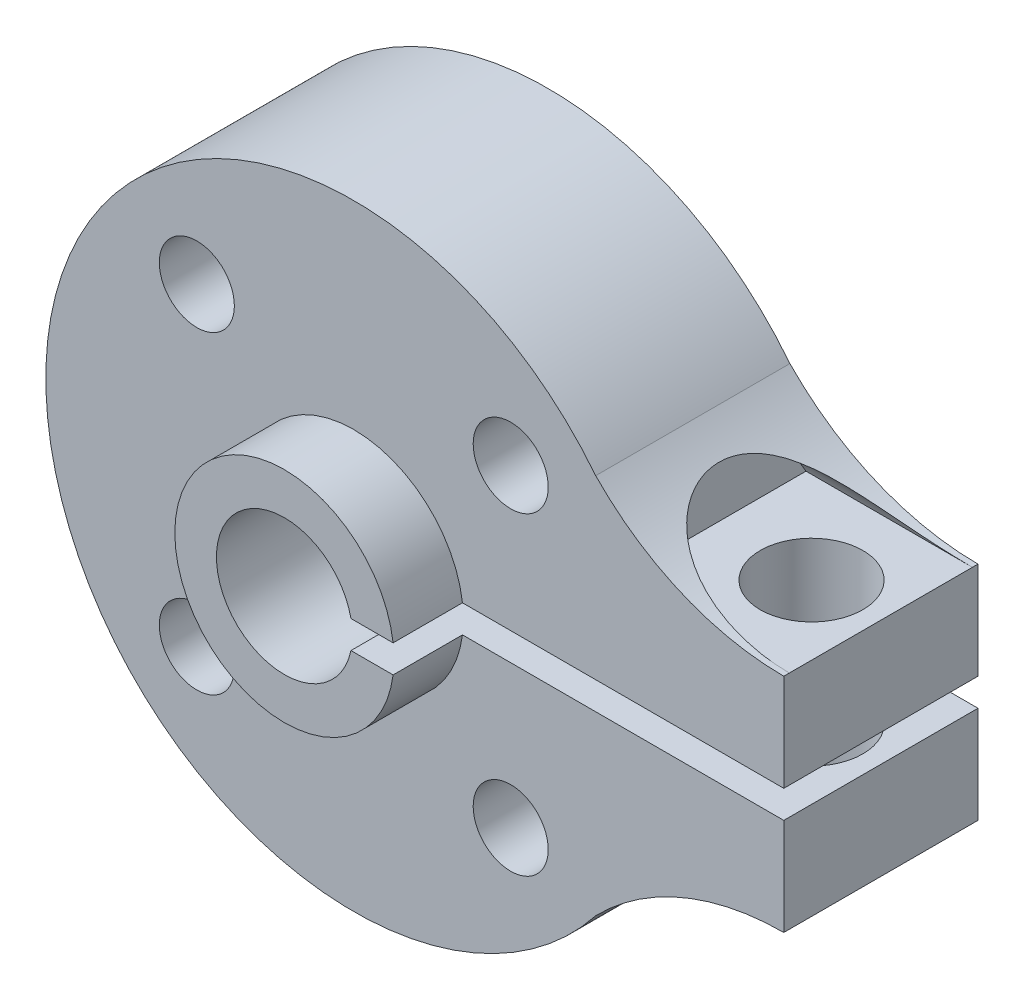
ISO-10303-21;
HEADER;
FILE_DESCRIPTION(('STEP AP214'),'2;1');
FILE_NAME('part.step','',(''),(''),'','','');
FILE_SCHEMA(('AUTOMOTIVE_DESIGN { 1 0 10303 214 1 1 1 1 }'));
ENDSEC;
DATA;
#1=APPLICATION_CONTEXT('core data for automotive mechanical design processes');
#2=APPLICATION_PROTOCOL_DEFINITION('international standard','automotive_design',2000,#1);
#3=PRODUCT_CONTEXT('',#1,'mechanical');
#4=PRODUCT('Part','Part','',(#3));
#5=PRODUCT_RELATED_PRODUCT_CATEGORY('part','',(#4));
#6=PRODUCT_DEFINITION_FORMATION('','',#4);
#7=PRODUCT_DEFINITION_CONTEXT('part definition',#1,'design');
#8=PRODUCT_DEFINITION('design','',#6,#7);
#9=PRODUCT_DEFINITION_SHAPE('','',#8);
#10=(LENGTH_UNIT() NAMED_UNIT(*) SI_UNIT(.MILLI.,.METRE.));
#11=(NAMED_UNIT(*) PLANE_ANGLE_UNIT() SI_UNIT($,.RADIAN.));
#12=(NAMED_UNIT(*) SI_UNIT($,.STERADIAN.) SOLID_ANGLE_UNIT());
#13=UNCERTAINTY_MEASURE_WITH_UNIT(LENGTH_MEASURE(1.E-05),#10,'distance_accuracy_value','');
#14=(GEOMETRIC_REPRESENTATION_CONTEXT(3) GLOBAL_UNCERTAINTY_ASSIGNED_CONTEXT((#13)) GLOBAL_UNIT_ASSIGNED_CONTEXT((#10,
#11,#12)) REPRESENTATION_CONTEXT('',''));
#15=CARTESIAN_POINT('',(0.,0.,0.));
#16=DIRECTION('',(0.,0.,1.));
#17=DIRECTION('',(1.,0.,0.));
#18=AXIS2_PLACEMENT_3D('',#15,#16,#17);
#19=CARTESIAN_POINT('',(15.5,-0.5,-7.));
#20=DIRECTION('',(1.,0.,0.));
#21=DIRECTION('',(0.,0.,-1.));
#22=AXIS2_PLACEMENT_3D('',#19,#20,#21);
#23=PLANE('',#22);
#24=DIRECTION('',(0.,0.,-1.));
#25=VECTOR('',#24,1.);
#26=CARTESIAN_POINT('',(15.5,0.5,2.5));
#27=LINE('',#26,#25);
#28=CARTESIAN_POINT('',(15.5,0.5,0.));
#29=VERTEX_POINT('',#28);
#30=CARTESIAN_POINT('',(15.5,0.5,-7.));
#31=VERTEX_POINT('',#30);
#32=EDGE_CURVE('E359',#29,#31,#27,.T.);
#33=ORIENTED_EDGE('',*,*,#32,.T.);
#34=DIRECTION('',(0.,1.,0.));
#35=VECTOR('',#34,1.);
#36=CARTESIAN_POINT('',(15.5,-13.4475790201,-7.));
#37=LINE('',#36,#35);
#38=CARTESIAN_POINT('',(15.5,4.000000000001,-7.));
#39=VERTEX_POINT('',#38);
#40=EDGE_CURVE('E318',#31,#39,#37,.T.);
#41=ORIENTED_EDGE('',*,*,#40,.T.);
#42=DIRECTION('',(0.,0.,1.));
#43=VECTOR('',#42,1.);
#44=CARTESIAN_POINT('',(15.5,4.000000000001,-7.));
#45=LINE('',#44,#43);
#46=CARTESIAN_POINT('',(15.5,4.0000000000005,-6.79999999999967));
#47=VERTEX_POINT('',#46);
#48=EDGE_CURVE('E136',#39,#47,#45,.T.);
#49=ORIENTED_EDGE('',*,*,#48,.T.);
#50=DIRECTION('',(0.,0.,-1.));
#51=VECTOR('',#50,1.);
#52=CARTESIAN_POINT('',(15.5,4.,-7.));
#53=LINE('',#52,#51);
#54=CARTESIAN_POINT('',(15.5,4.0000000000005,-0.200000000000335));
#55=VERTEX_POINT('',#54);
#56=EDGE_CURVE('E122',#47,#55,#53,.F.);
#57=ORIENTED_EDGE('',*,*,#56,.T.);
#58=DIRECTION('',(0.,0.,1.));
#59=VECTOR('',#58,1.);
#60=CARTESIAN_POINT('',(15.5,4.000000000001,-7.));
#61=LINE('',#60,#59);
#62=CARTESIAN_POINT('',(15.5,4.000000000001,0.));
#63=VERTEX_POINT('',#62);
#64=EDGE_CURVE('E121',#55,#63,#61,.T.);
#65=ORIENTED_EDGE('',*,*,#64,.T.);
#66=DIRECTION('',(0.,1.,0.));
#67=VECTOR('',#66,1.);
#68=CARTESIAN_POINT('',(15.5,-13.4475790201,0.));
#69=LINE('',#68,#67);
#70=EDGE_CURVE('E223',#29,#63,#69,.T.);
#71=ORIENTED_EDGE('',*,*,#70,.F.);
#72=EDGE_LOOP('',(#33,#41,#49,#57,#65,#71));
#73=FACE_BOUND('',#72,.T.);
#74=ADVANCED_FACE('F45',(#73),#23,.T.);
#75=CARTESIAN_POINT('',(15.5,-13.4475790201,0.));
#76=DIRECTION('',(0.,0.,1.));
#77=DIRECTION('',(1.,0.,0.));
#78=AXIS2_PLACEMENT_3D('',#75,#76,#77);
#79=PLANE('',#78);
#80=CARTESIAN_POINT('',(-5.656516224816,5.657192253971,0.));
#81=DIRECTION('',(0.,0.,1.));
#82=DIRECTION('',(1.,0.,0.));
#83=AXIS2_PLACEMENT_3D('',#80,#81,#82);
#84=CIRCLE('',#83,1.35254999999999);
#85=CARTESIAN_POINT('',(-4.30396622481601,5.657192253971,0.));
#86=VERTEX_POINT('',#85);
#87=EDGE_CURVE('E397',#86,#86,#84,.T.);
#88=ORIENTED_EDGE('',*,*,#87,.F.);
#89=EDGE_LOOP('',(#88));
#90=FACE_BOUND('',#89,.T.);
#91=CARTESIAN_POINT('',(5.657192253971,5.656516224816,0.));
#92=DIRECTION('',(0.,0.,1.));
#93=DIRECTION('',(1.,0.,0.));
#94=AXIS2_PLACEMENT_3D('',#91,#92,#93);
#95=CIRCLE('',#94,1.35254999999999);
#96=CARTESIAN_POINT('',(7.00974225397099,5.656516224816,0.));
#97=VERTEX_POINT('',#96);
#98=EDGE_CURVE('E391',#97,#97,#95,.T.);
#99=ORIENTED_EDGE('',*,*,#98,.F.);
#100=EDGE_LOOP('',(#99));
#101=FACE_BOUND('',#100,.T.);
#102=CARTESIAN_POINT('',(5.656516224816,-5.657192253971,0.));
#103=DIRECTION('',(0.,0.,1.));
#104=DIRECTION('',(1.,0.,0.));
#105=AXIS2_PLACEMENT_3D('',#102,#103,#104);
#106=CIRCLE('',#105,1.35254999999999);
#107=CARTESIAN_POINT('',(7.00906622481599,-5.657192253971,0.));
#108=VERTEX_POINT('',#107);
#109=EDGE_CURVE('E385',#108,#108,#106,.T.);
#110=ORIENTED_EDGE('',*,*,#109,.F.);
#111=EDGE_LOOP('',(#110));
#112=FACE_BOUND('',#111,.T.);
#113=CARTESIAN_POINT('',(-5.657192253971,-5.656516224816,0.));
#114=DIRECTION('',(0.,0.,1.));
#115=DIRECTION('',(1.,0.,0.));
#116=AXIS2_PLACEMENT_3D('',#113,#114,#115);
#117=CIRCLE('',#116,1.35254999999999);
#118=CARTESIAN_POINT('',(-4.30464225397101,-5.656516224816,0.));
#119=VERTEX_POINT('',#118);
#120=EDGE_CURVE('E379',#119,#119,#117,.T.);
#121=ORIENTED_EDGE('',*,*,#120,.F.);
#122=EDGE_LOOP('',(#121));
#123=FACE_BOUND('',#122,.T.);
#124=DIRECTION('',(-1.,0.,0.));
#125=VECTOR('',#124,1.);
#126=CARTESIAN_POINT('',(15.5,0.5,0.));
#127=LINE('',#126,#125);
#128=CARTESIAN_POINT('',(3.91822663969301,0.5,0.));
#129=VERTEX_POINT('',#128);
#130=EDGE_CURVE('E344',#29,#129,#127,.T.);
#131=ORIENTED_EDGE('',*,*,#130,.F.);
#132=ORIENTED_EDGE('',*,*,#70,.T.);
#133=CARTESIAN_POINT('',(15.5,13.4475790201,0.));
#134=DIRECTION('',(0.,0.,1.));
#135=DIRECTION('',(1.,0.,0.));
#136=AXIS2_PLACEMENT_3D('',#133,#134,#135);
#137=CIRCLE('',#136,9.447579020099);
#138=CARTESIAN_POINT('',(8.71986454121394,6.86833039267039,0.));
#139=VERTEX_POINT('',#138);
#140=EDGE_CURVE('E141',#63,#139,#137,.F.);
#141=ORIENTED_EDGE('',*,*,#140,.T.);
#142=CARTESIAN_POINT('',(0.,0.,0.));
#143=DIRECTION('',(0.,0.,1.));
#144=DIRECTION('',(1.,0.,0.));
#145=AXIS2_PLACEMENT_3D('',#142,#143,#144);
#146=CIRCLE('',#145,11.1);
#147=CARTESIAN_POINT('',(8.71986454121394,-6.86833039267039,0.));
#148=VERTEX_POINT('',#147);
#149=EDGE_CURVE('E58',#148,#139,#146,.F.);
#150=ORIENTED_EDGE('',*,*,#149,.F.);
#151=CARTESIAN_POINT('',(15.5,-13.4475790201,0.));
#152=DIRECTION('',(0.,0.,1.));
#153=DIRECTION('',(1.,0.,0.));
#154=AXIS2_PLACEMENT_3D('',#151,#152,#153);
#155=CIRCLE('',#154,9.447579020099);
#156=CARTESIAN_POINT('',(15.5,-4.000000000001,0.));
#157=VERTEX_POINT('',#156);
#158=EDGE_CURVE('E74',#148,#157,#155,.F.);
#159=ORIENTED_EDGE('',*,*,#158,.T.);
#160=CARTESIAN_POINT('',(15.5,-0.5,0.));
#161=VERTEX_POINT('',#160);
#162=EDGE_CURVE('E200',#157,#161,#69,.T.);
#163=ORIENTED_EDGE('',*,*,#162,.T.);
#164=DIRECTION('',(1.,0.,0.));
#165=VECTOR('',#164,1.);
#166=CARTESIAN_POINT('',(15.5,-0.5,0.));
#167=LINE('',#166,#165);
#168=CARTESIAN_POINT('',(3.91822663969301,-0.5,0.));
#169=VERTEX_POINT('',#168);
#170=EDGE_CURVE('E352',#169,#161,#167,.T.);
#171=ORIENTED_EDGE('',*,*,#170,.F.);
#172=CARTESIAN_POINT('',(0.,0.,0.));
#173=DIRECTION('',(0.,0.,1.));
#174=DIRECTION('',(1.,0.,0.));
#175=AXIS2_PLACEMENT_3D('',#172,#173,#174);
#176=CIRCLE('',#175,3.95);
#177=EDGE_CURVE('E341',#129,#169,#176,.T.);
#178=ORIENTED_EDGE('',*,*,#177,.F.);
#179=EDGE_LOOP('',(#131,#132,#141,#150,#159,#163,#171,#178));
#180=FACE_BOUND('',#179,.T.);
#181=ADVANCED_FACE('F273',(#90,#101,#112,#123,#180),#79,.T.);
#182=CARTESIAN_POINT('',(9.5,4.,-0.2));
#183=DIRECTION('',(0.,-1.,0.));
#184=DIRECTION('',(0.,0.,-1.));
#185=AXIS2_PLACEMENT_3D('',#182,#183,#184);
#186=PLANE('',#185);
#187=CARTESIAN_POINT('',(13.,4.,-3.5));
#188=DIRECTION('',(0.,1.,0.));
#189=DIRECTION('',(0.,0.,1.));
#190=AXIS2_PLACEMENT_3D('',#187,#188,#189);
#191=CIRCLE('',#190,1.84999999999999);
#192=CARTESIAN_POINT('',(13.,4.,-1.65000000000001));
#193=VERTEX_POINT('',#192);
#194=EDGE_CURVE('E409',#193,#193,#191,.T.);
#195=ORIENTED_EDGE('',*,*,#194,.F.);
#196=EDGE_LOOP('',(#195));
#197=FACE_BOUND('',#196,.T.);
#198=DIRECTION('',(1.,0.,0.));
#199=VECTOR('',#198,1.);
#200=CARTESIAN_POINT('',(9.5,3.99999999999994,-6.79999999999987));
#201=LINE('',#200,#199);
#202=CARTESIAN_POINT('',(9.5,3.99999999999997,-6.79999999999986));
#203=VERTEX_POINT('',#202);
#204=EDGE_CURVE('E115',#47,#203,#201,.F.);
#205=ORIENTED_EDGE('',*,*,#204,.T.);
#206=DIRECTION('',(0.,0.,-1.));
#207=VECTOR('',#206,1.);
#208=CARTESIAN_POINT('',(9.5,3.99999999999997,-0.200000000000142));
#209=LINE('',#208,#207);
#210=CARTESIAN_POINT('',(9.5,3.99999999999997,-0.200000000000142));
#211=VERTEX_POINT('',#210);
#212=EDGE_CURVE('E128',#211,#203,#209,.T.);
#213=ORIENTED_EDGE('',*,*,#212,.F.);
#214=DIRECTION('',(1.,0.,0.));
#215=VECTOR('',#214,1.);
#216=CARTESIAN_POINT('',(9.5,3.99999999999994,-0.200000000000125));
#217=LINE('',#216,#215);
#218=EDGE_CURVE('E112',#211,#55,#217,.T.);
#219=ORIENTED_EDGE('',*,*,#218,.T.);
#220=ORIENTED_EDGE('',*,*,#56,.F.);
#221=EDGE_LOOP('',(#205,#213,#219,#220));
#222=FACE_BOUND('',#221,.T.);
#223=ADVANCED_FACE('F47',(#197,#222),#186,.F.);
#224=CARTESIAN_POINT('',(9.5,2.308194299318,-3.5));
#225=DIRECTION('',(1.,0.,0.));
#226=DIRECTION('',(0.,0.,-1.));
#227=AXIS2_PLACEMENT_3D('',#224,#225,#226);
#228=CYLINDRICAL_SURFACE('',#227,3.708396759903);
#229=ORIENTED_EDGE('',*,*,#218,.F.);
#230=CARTESIAN_POINT('',(9.5,2.308194299318,-3.5));
#231=DIRECTION('',(1.,0.,0.));
#232=DIRECTION('',(0.,0.,-1.));
#233=AXIS2_PLACEMENT_3D('',#230,#231,#232);
#234=CIRCLE('',#233,3.708396759903);
#235=EDGE_CURVE('E337',#203,#211,#234,.T.);
#236=ORIENTED_EDGE('',*,*,#235,.F.);
#237=ORIENTED_EDGE('',*,*,#204,.F.);
#238=CARTESIAN_POINT('',(15.5,4.000000000001,-6.79999999999933));
#239=CARTESIAN_POINT('',(15.3854172561424,3.99999807144366,-6.7999904035741));
#240=CARTESIAN_POINT('',(15.2708345037205,4.00208452565223,-6.79893104370679));
#241=CARTESIAN_POINT('',(15.0418545088415,4.01042007363627,-6.79464326988314));
#242=CARTESIAN_POINT('',(14.9274572778291,4.01666941510702,-6.79141472685848));
#243=CARTESIAN_POINT('',(14.6988557808847,4.033330584123,-6.78271174393158));
#244=CARTESIAN_POINT('',(14.5846521614544,4.04374938302985,-6.77723354218102));
#245=CARTESIAN_POINT('',(14.3568466591298,4.06871528645758,-6.76388854983073));
#246=CARTESIAN_POINT('',(14.2432447653975,4.08326231636308,-6.7560218024024));
#247=CARTESIAN_POINT('',(13.9012476272517,4.1333872690603,-6.72837211210126));
#248=CARTESIAN_POINT('',(13.6740472792939,4.17527511633308,-6.70462249151927));
#249=CARTESIAN_POINT('',(13.2250868669367,4.27510326310617,-6.64434186929708));
#250=CARTESIAN_POINT('',(13.0033221022713,4.33302911979379,-6.6078223596639));
#251=CARTESIAN_POINT('',(12.6529356022988,4.43813091397781,-6.5360933101411));
#252=CARTESIAN_POINT('',(12.5218503492449,4.48063203510989,-6.50597227338658));
#253=CARTESIAN_POINT('',(12.2632290057736,4.57071030493148,-6.4387742668089));
#254=CARTESIAN_POINT('',(12.1356928962293,4.61828742625897,-6.40169733448045));
#255=CARTESIAN_POINT('',(11.8854487831593,4.71775519771889,-6.31963922664217));
#256=CARTESIAN_POINT('',(11.7627254940685,4.76963022726134,-6.27468606548825));
#257=CARTESIAN_POINT('',(11.5227135874733,4.87697578128279,-6.17561107592043));
#258=CARTESIAN_POINT('',(11.4054232772463,4.93244517278872,-6.12149212804335));
#259=CARTESIAN_POINT('',(11.1256985684184,5.07163984609245,-5.97585734382027));
#260=CARTESIAN_POINT('',(10.9669053561294,5.15677415238754,-5.87851068639026));
#261=CARTESIAN_POINT('',(10.6682954041519,5.32718244619876,-5.65805983866001));
#262=CARTESIAN_POINT('',(10.5284532138092,5.41245608755708,-5.53499076935242));
#263=CARTESIAN_POINT('',(10.3029570714859,5.5570021638199,-5.29236628463541));
#264=CARTESIAN_POINT('',(10.2122236670473,5.61776209979507,-5.17843958840104));
#265=CARTESIAN_POINT('',(10.0487893069128,5.73065496290757,-4.9342150554859));
#266=CARTESIAN_POINT('',(9.97608268610899,5.78279059860418,-4.80392238142926));
#267=CARTESIAN_POINT('',(9.88271984953715,5.85123562170807,-4.59746178007822));
#268=CARTESIAN_POINT('',(9.85411340712846,5.87250463892861,-4.5264262545005));
#269=CARTESIAN_POINT('',(9.80265428832986,5.9111320266464,-4.38128999145526));
#270=CARTESIAN_POINT('',(9.77979860146265,5.92849244276414,-4.30719088150572));
#271=CARTESIAN_POINT('',(9.74015073098196,5.9588198482869,-4.15653545136068));
#272=CARTESIAN_POINT('',(9.72335620443627,5.97178853518828,-4.07998009311161));
#273=CARTESIAN_POINT('',(9.696047876865,5.99297113329569,-3.92514115874171));
#274=CARTESIAN_POINT('',(9.68553304823525,6.00118582243485,-3.84685786755357));
#275=CARTESIAN_POINT('',(9.66571269419219,6.01668686364098,-3.63272797682019));
#276=CARTESIAN_POINT('',(9.66268060711631,6.01908388455562,-3.49585578487399));
#277=CARTESIAN_POINT('',(9.67580092483682,6.00879517138083,-3.22372435833189));
#278=CARTESIAN_POINT('',(9.69194697787978,5.99611443100789,-3.08846460468274));
#279=CARTESIAN_POINT('',(9.74140060570531,5.95784036040179,-2.83033541035466));
#280=CARTESIAN_POINT('',(9.77379479620589,5.93293564756332,-2.7071855921698));
#281=CARTESIAN_POINT('',(9.85403038461476,5.872469667333,-2.46884489684085));
#282=CARTESIAN_POINT('',(9.90187372262332,5.83690706156584,-2.35365502151125));
#283=CARTESIAN_POINT('',(10.0153708669385,5.7546713103554,-2.12530832541407));
#284=CARTESIAN_POINT('',(10.0820564209881,5.70738398145087,-2.01289063057066));
#285=CARTESIAN_POINT('',(10.22922218102,5.60643161923737,-1.80068540326632));
#286=CARTESIAN_POINT('',(10.309709454311,5.55276332282879,-1.70090438727932));
#287=CARTESIAN_POINT('',(10.4617575283387,5.45514545743429,-1.53638994983432));
#288=CARTESIAN_POINT('',(10.5309064551325,5.41191057285581,-1.46895760039852));
#289=CARTESIAN_POINT('',(10.6750840937544,5.324523005541,-1.34130785397833));
#290=CARTESIAN_POINT('',(10.7501152592569,5.28036994550683,-1.28109349462586));
#291=CARTESIAN_POINT('',(10.9053325302062,5.19204954805676,-1.16745307872609));
#292=CARTESIAN_POINT('',(10.9855265073732,5.14788229613576,-1.11403777634661));
#293=CARTESIAN_POINT('',(11.1502648300501,5.06037063385568,-1.01360351201172));
#294=CARTESIAN_POINT('',(11.2348105538105,5.01702649020907,-0.966586593895724));
#295=CARTESIAN_POINT('',(11.4491601443286,4.91131764268612,-0.857234031716602));
#296=CARTESIAN_POINT('',(11.5811855099728,4.8498240739921,-0.798397249947358));
#297=CARTESIAN_POINT('',(11.8517008005578,4.73158833415588,-0.691850969184867));
#298=CARTESIAN_POINT('',(11.9901938582427,4.67484850353973,-0.644146931053634));
#299=CARTESIAN_POINT('',(12.2727994055449,4.5669886617629,-0.558090419685307));
#300=CARTESIAN_POINT('',(12.4169310013115,4.51589049754474,-0.519773645045218));
#301=CARTESIAN_POINT('',(12.7092115298463,4.42029218777587,-0.451279086549204));
#302=CARTESIAN_POINT('',(12.8573601583155,4.37579154409137,-0.421100688078936));
#303=CARTESIAN_POINT('',(13.2088503671513,4.27964035910178,-0.358348077633359));
#304=CARTESIAN_POINT('',(13.4134887431066,4.2308754157282,-0.328582782000245));
#305=CARTESIAN_POINT('',(13.8267983828851,4.14695137700744,-0.27920251319476));
#306=CARTESIAN_POINT('',(14.0354716910446,4.11179937907123,-0.259592833085457));
#307=CARTESIAN_POINT('',(14.4530137871783,4.05585754801128,-0.229084764078983));
#308=CARTESIAN_POINT('',(14.6618549020669,4.03491321046744,-0.218092452134431));
#309=CARTESIAN_POINT('',(14.9758505914236,4.01396785329366,-0.207190475716648));
#310=CARTESIAN_POINT('',(15.0805924216452,4.00873126349106,-0.204487528313254));
#311=CARTESIAN_POINT('',(15.2902194458755,4.00174728093327,-0.20089500314409));
#312=CARTESIAN_POINT('',(15.3951046341522,3.99999975253445,-0.200005354882977));
#313=CARTESIAN_POINT('',(15.5,4.000000000001,-0.20000000000067));
#314=B_SPLINE_CURVE_WITH_KNOTS('',3,(#238,#239,#240,#241,#242,#243,#244,#245,#246,#247,#248,
#249,#250,#251,#252,#253,#254,#255,#256,#257,#258,#259,#260,#261,#262,#263,#264,#265,#266,#267,
#268,#269,#270,#271,#272,#273,#274,#275,#276,#277,#278,#279,#280,#281,#282,#283,#284,#285,#286,
#287,#288,#289,#290,#291,#292,#293,#294,#295,#296,#297,#298,#299,#300,#301,#302,#303,#304,#305,
#306,#307,#308,#309,#310,#311,#312,#313),.UNSPECIFIED.,.F.,.F.,(4,2,2,2,2,2,2,2,2,2,2,2,2,2,2,2,
2,2,2,2,2,2,2,2,2,2,2,2,2,2,2,2,2,2,2,2,2,4),(0.,0.343723971843453,0.687468397378237,
1.03178998346866,1.37610534654163,2.07189509147115,2.76706027899586,3.18996821448582,
3.6128738704195,4.03430477997258,4.45560349113267,5.06790502421491,5.67937592856019,
6.15105760704194,6.62259086613528,6.86072027072375,7.09872475577593,7.33663714177156,
7.57451058532161,7.98295112010445,8.39125641808473,8.77882172170296,9.16643571462009,
9.58186622266672,9.99751009479279,10.3145531519351,10.6317291690766,10.9494007936113,
11.2671736551701,11.7376814003825,12.20841945742,12.6809208132666,13.1533864755692,
13.7899635271677,14.4268720269268,15.0567382504871,15.37139764566,15.686044807636),.UNSPECIFIED.);
#315=EDGE_CURVE('E107',#47,#55,#314,.T.);
#316=ORIENTED_EDGE('',*,*,#315,.T.);
#317=EDGE_LOOP('',(#229,#236,#237,#316));
#318=FACE_BOUND('',#317,.T.);
#319=ADVANCED_FACE('F109',(#318),#228,.F.);
#320=DIRECTION('',(0.,0.,-1.));
#321=VECTOR('',#320,1.);
#322=CARTESIAN_POINT('',(15.5,-0.5,2.5));
#323=LINE('',#322,#321);
#324=CARTESIAN_POINT('',(15.5,-0.5,-7.));
#325=VERTEX_POINT('',#324);
#326=EDGE_CURVE('E361',#161,#325,#323,.T.);
#327=ORIENTED_EDGE('',*,*,#326,.F.);
#328=ORIENTED_EDGE('',*,*,#162,.F.);
#329=DIRECTION('',(0.,0.,1.));
#330=VECTOR('',#329,1.);
#331=CARTESIAN_POINT('',(15.5,-4.000000000001,-7.));
#332=LINE('',#331,#330);
#333=CARTESIAN_POINT('',(15.5,-4.000000000001,-7.));
#334=VERTEX_POINT('',#333);
#335=EDGE_CURVE('E153',#157,#334,#332,.F.);
#336=ORIENTED_EDGE('',*,*,#335,.T.);
#337=EDGE_CURVE('E312',#334,#325,#37,.T.);
#338=ORIENTED_EDGE('',*,*,#337,.T.);
#339=EDGE_LOOP('',(#327,#328,#336,#338));
#340=FACE_BOUND('',#339,.T.);
#341=ADVANCED_FACE('F263',(#340),#23,.T.);
#342=CARTESIAN_POINT('',(15.5,13.4475790201,-7.));
#343=DIRECTION('',(0.,0.,1.));
#344=DIRECTION('',(1.,0.,0.));
#345=AXIS2_PLACEMENT_3D('',#342,#343,#344);
#346=CYLINDRICAL_SURFACE('',#345,9.447579020099);
#347=CARTESIAN_POINT('',(15.5,13.4475790201,-7.));
#348=DIRECTION('',(0.,0.,1.));
#349=DIRECTION('',(1.,0.,0.));
#350=AXIS2_PLACEMENT_3D('',#347,#348,#349);
#351=CIRCLE('',#350,9.447579020099);
#352=CARTESIAN_POINT('',(8.71986454121394,6.86833039267039,-7.));
#353=VERTEX_POINT('',#352);
#354=EDGE_CURVE('E147',#39,#353,#351,.F.);
#355=ORIENTED_EDGE('',*,*,#354,.T.);
#356=DIRECTION('',(0.,0.,1.));
#357=VECTOR('',#356,1.);
#358=CARTESIAN_POINT('',(8.71986454121638,6.8683303926673,-7.));
#359=LINE('',#358,#357);
#360=EDGE_CURVE('E203',#139,#353,#359,.F.);
#361=ORIENTED_EDGE('',*,*,#360,.F.);
#362=ORIENTED_EDGE('',*,*,#140,.F.);
#363=ORIENTED_EDGE('',*,*,#64,.F.);
#364=ORIENTED_EDGE('',*,*,#315,.F.);
#365=ORIENTED_EDGE('',*,*,#48,.F.);
#366=EDGE_LOOP('',(#355,#361,#362,#363,#364,#365));
#367=FACE_BOUND('',#366,.T.);
#368=ADVANCED_FACE('F139',(#367),#346,.F.);
#369=CARTESIAN_POINT('',(15.5,-13.4475790201,-7.));
#370=DIRECTION('',(0.,0.,1.));
#371=DIRECTION('',(1.,0.,0.));
#372=AXIS2_PLACEMENT_3D('',#369,#370,#371);
#373=PLANE('',#372);
#374=CARTESIAN_POINT('',(-5.656516224816,5.657192253971,-7.));
#375=DIRECTION('',(0.,0.,-1.));
#376=DIRECTION('',(-1.,0.,0.));
#377=AXIS2_PLACEMENT_3D('',#374,#375,#376);
#378=CIRCLE('',#377,1.35254999999999);
#379=CARTESIAN_POINT('',(-7.00906622481599,5.657192253971,-7.));
#380=VERTEX_POINT('',#379);
#381=EDGE_CURVE('E400',#380,#380,#378,.T.);
#382=ORIENTED_EDGE('',*,*,#381,.F.);
#383=EDGE_LOOP('',(#382));
#384=FACE_BOUND('',#383,.T.);
#385=CARTESIAN_POINT('',(5.657192253971,5.656516224816,-7.));
#386=DIRECTION('',(0.,0.,-1.));
#387=DIRECTION('',(-1.,0.,0.));
#388=AXIS2_PLACEMENT_3D('',#385,#386,#387);
#389=CIRCLE('',#388,1.35254999999999);
#390=CARTESIAN_POINT('',(4.30464225397101,5.656516224816,-7.));
#391=VERTEX_POINT('',#390);
#392=EDGE_CURVE('E394',#391,#391,#389,.T.);
#393=ORIENTED_EDGE('',*,*,#392,.F.);
#394=EDGE_LOOP('',(#393));
#395=FACE_BOUND('',#394,.T.);
#396=CARTESIAN_POINT('',(5.656516224816,-5.657192253971,-7.));
#397=DIRECTION('',(0.,0.,-1.));
#398=DIRECTION('',(-1.,0.,0.));
#399=AXIS2_PLACEMENT_3D('',#396,#397,#398);
#400=CIRCLE('',#399,1.35254999999999);
#401=CARTESIAN_POINT('',(4.30396622481601,-5.657192253971,-7.));
#402=VERTEX_POINT('',#401);
#403=EDGE_CURVE('E388',#402,#402,#400,.T.);
#404=ORIENTED_EDGE('',*,*,#403,.F.);
#405=EDGE_LOOP('',(#404));
#406=FACE_BOUND('',#405,.T.);
#407=CARTESIAN_POINT('',(-5.657192253971,-5.656516224816,-7.));
#408=DIRECTION('',(0.,0.,-1.));
#409=DIRECTION('',(-1.,0.,0.));
#410=AXIS2_PLACEMENT_3D('',#407,#408,#409);
#411=CIRCLE('',#410,1.35254999999999);
#412=CARTESIAN_POINT('',(-7.00974225397099,-5.656516224816,-7.));
#413=VERTEX_POINT('',#412);
#414=EDGE_CURVE('E382',#413,#413,#411,.T.);
#415=ORIENTED_EDGE('',*,*,#414,.F.);
#416=EDGE_LOOP('',(#415));
#417=FACE_BOUND('',#416,.T.);
#418=DIRECTION('',(1.,0.,0.));
#419=VECTOR('',#418,1.);
#420=CARTESIAN_POINT('',(2.39843699104215,0.5,-7.));
#421=LINE('',#420,#419);
#422=CARTESIAN_POINT('',(2.39843699104215,0.5,-7.));
#423=VERTEX_POINT('',#422);
#424=EDGE_CURVE('E370',#423,#31,#421,.T.);
#425=ORIENTED_EDGE('',*,*,#424,.F.);
#426=CARTESIAN_POINT('',(0.,0.,-7.));
#427=DIRECTION('',(0.,0.,-1.));
#428=DIRECTION('',(-1.,0.,0.));
#429=AXIS2_PLACEMENT_3D('',#426,#427,#428);
#430=CIRCLE('',#429,2.44999999999986);
#431=CARTESIAN_POINT('',(2.39843699104215,-0.5,-7.));
#432=VERTEX_POINT('',#431);
#433=EDGE_CURVE('E376',#432,#423,#430,.T.);
#434=ORIENTED_EDGE('',*,*,#433,.F.);
#435=DIRECTION('',(-1.,0.,0.));
#436=VECTOR('',#435,1.);
#437=CARTESIAN_POINT('',(15.5,-0.5,-7.));
#438=LINE('',#437,#436);
#439=EDGE_CURVE('E316',#325,#432,#438,.T.);
#440=ORIENTED_EDGE('',*,*,#439,.F.);
#441=ORIENTED_EDGE('',*,*,#337,.F.);
#442=CARTESIAN_POINT('',(15.5,-13.4475790201,-7.));
#443=DIRECTION('',(0.,0.,1.));
#444=DIRECTION('',(1.,0.,0.));
#445=AXIS2_PLACEMENT_3D('',#442,#443,#444);
#446=CIRCLE('',#445,9.447579020099);
#447=CARTESIAN_POINT('',(8.71986454121394,-6.86833039267039,-7.));
#448=VERTEX_POINT('',#447);
#449=EDGE_CURVE('E225',#334,#448,#446,.T.);
#450=ORIENTED_EDGE('',*,*,#449,.T.);
#451=CARTESIAN_POINT('',(0.,0.,-7.));
#452=DIRECTION('',(0.,0.,1.));
#453=DIRECTION('',(1.,0.,0.));
#454=AXIS2_PLACEMENT_3D('',#451,#452,#453);
#455=CIRCLE('',#454,11.1);
#456=EDGE_CURVE('E199',#353,#448,#455,.T.);
#457=ORIENTED_EDGE('',*,*,#456,.F.);
#458=ORIENTED_EDGE('',*,*,#354,.F.);
#459=ORIENTED_EDGE('',*,*,#40,.F.);
#460=EDGE_LOOP('',(#425,#434,#440,#441,#450,#457,#458,#459));
#461=FACE_BOUND('',#460,.T.);
#462=ADVANCED_FACE('F262',(#384,#395,#406,#417,#461),#373,.F.);
#463=CARTESIAN_POINT('',(15.5,-13.4475790201,-7.));
#464=DIRECTION('',(0.,0.,1.));
#465=DIRECTION('',(1.,0.,0.));
#466=AXIS2_PLACEMENT_3D('',#463,#464,#465);
#467=CYLINDRICAL_SURFACE('',#466,9.447579020099);
#468=CARTESIAN_POINT('',(13.,-4.3367750302748,-1.65000000000001));
#469=CARTESIAN_POINT('',(13.1020931348416,-4.30876184143785,-1.65000231823032));
#470=CARTESIAN_POINT('',(13.2046904400452,-4.28247031444119,-1.65847202485946));
#471=CARTESIAN_POINT('',(13.408004755857,-4.23393494095953,-1.69260969729781));
#472=CARTESIAN_POINT('',(13.5087213015543,-4.21169208369675,-1.71828185907491));
#473=CARTESIAN_POINT('',(13.7053069652672,-4.17148563496231,-1.78655929249173));
#474=CARTESIAN_POINT('',(13.8011700519531,-4.15352726969829,-1.82918507685238));
#475=CARTESIAN_POINT('',(13.9848203688907,-4.12182572869037,-1.93040781643459));
#476=CARTESIAN_POINT('',(14.0726084076673,-4.10808213061496,-1.9890031703484));
#477=CARTESIAN_POINT('',(14.2354237967839,-4.08466137590179,-2.1191129061892));
#478=CARTESIAN_POINT('',(14.3106897705263,-4.0749012624876,-2.19031405120265));
#479=CARTESIAN_POINT('',(14.4484274499805,-4.05844871599766,-2.34447355155204));
#480=CARTESIAN_POINT('',(14.5108994436398,-4.05175621387659,-2.42743164220942));
#481=CARTESIAN_POINT('',(14.6208488375966,-4.0408319796604,-2.60225036038632));
#482=CARTESIAN_POINT('',(14.6684068977798,-4.03658690253054,-2.69405945999747));
#483=CARTESIAN_POINT('',(14.7476034672671,-4.02992343759962,-2.88436634710738));
#484=CARTESIAN_POINT('',(14.779241745117,-4.02750507635653,-2.98286423182929));
#485=CARTESIAN_POINT('',(14.8257793826209,-4.02405905592491,-3.18417548258697));
#486=CARTESIAN_POINT('',(14.8406115686396,-4.02303697431847,-3.2870044747117));
#487=CARTESIAN_POINT('',(14.8528840482306,-4.02218622048448,-3.49370091027606));
#488=CARTESIAN_POINT('',(14.8503240418029,-4.02235756884255,-3.59756837159752));
#489=CARTESIAN_POINT('',(14.8278599147088,-4.0239331393068,-3.80363336349727));
#490=CARTESIAN_POINT('',(14.807917710586,-4.02534006855514,-3.90582672501863));
#491=CARTESIAN_POINT('',(14.7512134740152,-4.02967746168742,-4.10540282894017));
#492=CARTESIAN_POINT('',(14.7144514248949,-4.03260792708153,-4.20278556657184));
#493=CARTESIAN_POINT('',(14.6252213557579,-4.0404803303483,-4.38988066547789));
#494=CARTESIAN_POINT('',(14.5727666494669,-4.045420564397,-4.47959944626994));
#495=CARTESIAN_POINT('',(14.4537061994555,-4.05792574934454,-4.64888877188974));
#496=CARTESIAN_POINT('',(14.3871010986384,-4.06549058100834,-4.72845977750468));
#497=CARTESIAN_POINT('',(14.2420560713792,-4.08383854111428,-4.87490971931079));
#498=CARTESIAN_POINT('',(14.163662933287,-4.09460910409363,-4.94183657234153));
#499=CARTESIAN_POINT('',(13.9972809840614,-4.1198969684917,-5.06154841566373));
#500=CARTESIAN_POINT('',(13.9092926803011,-4.13441407185633,-5.11433415319916));
#501=CARTESIAN_POINT('',(13.7265190009022,-4.16748620265437,-5.2044186470398));
#502=CARTESIAN_POINT('',(13.6317392206275,-4.18603793111348,-5.24172998419542));
#503=CARTESIAN_POINT('',(13.438175461112,-4.22719848938012,-5.30020205562216));
#504=CARTESIAN_POINT('',(13.3393912098856,-4.24980759512532,-5.32136169091969));
#505=CARTESIAN_POINT('',(13.1387776855902,-4.29923248216314,-5.34761064837547));
#506=CARTESIAN_POINT('',(13.0369259535202,-4.32611870182588,-5.35239366192299));
#507=CARTESIAN_POINT('',(12.8347217069308,-4.38313821552344,-5.34537940854024));
#508=CARTESIAN_POINT('',(12.7343695256056,-4.4132722193377,-5.33357851050608));
#509=CARTESIAN_POINT('',(12.5331715548735,-4.47727714857583,-5.29320026775266));
#510=CARTESIAN_POINT('',(12.4325066924236,-4.51125520524717,-5.26389201568042));
#511=CARTESIAN_POINT('',(12.2378865031043,-4.58044600559339,-5.18895402070606));
#512=CARTESIAN_POINT('',(12.1439333832064,-4.61565914976945,-5.14331893854295));
#513=CARTESIAN_POINT('',(11.9608343861587,-4.68737596756608,-5.03443453708052));
#514=CARTESIAN_POINT('',(11.8721023801529,-4.7238653692071,-4.9704776062173));
#515=CARTESIAN_POINT('',(11.7067211556537,-4.79449385021687,-4.82736165465723));
#516=CARTESIAN_POINT('',(11.6300741726784,-4.82863249408016,-4.74819982731361));
#517=CARTESIAN_POINT('',(11.4919042494529,-4.8920161318829,-4.57709429369107));
#518=CARTESIAN_POINT('',(11.4302573967812,-4.92130053485029,-4.48526586916134));
#519=CARTESIAN_POINT('',(11.3237618156207,-4.97295170031687,-4.29057442927397));
#520=CARTESIAN_POINT('',(11.2788996565754,-4.9953239911513,-4.18772032145876));
#521=CARTESIAN_POINT('',(11.211385474192,-5.02939361430454,-3.98360363233784));
#522=CARTESIAN_POINT('',(11.1871202440867,-5.04185997573142,-3.88300459488486));
#523=CARTESIAN_POINT('',(11.1557344048537,-5.05803588400625,-3.67850044523484));
#524=CARTESIAN_POINT('',(11.1486013729504,-5.06175177589316,-3.57459778396533));
#525=CARTESIAN_POINT('',(11.1517045400376,-5.06014411436288,-3.37687748048666));
#526=CARTESIAN_POINT('',(11.1603814050421,-5.05563205114184,-3.28302387627801));
#527=CARTESIAN_POINT('',(11.1917061339106,-5.039507909544,-3.09832058413497));
#528=CARTESIAN_POINT('',(11.2143541536373,-5.02789575195825,-3.00747092972469));
#529=CARTESIAN_POINT('',(11.2725991583298,-4.99850319073831,-2.83127846487411));
#530=CARTESIAN_POINT('',(11.3081761496744,-4.98073231302893,-2.74592738995429));
#531=CARTESIAN_POINT('',(11.3909974088227,-4.94023126166121,-2.58238340240984));
#532=CARTESIAN_POINT('',(11.4382448871108,-4.91749972355437,-2.50419246762565));
#533=CARTESIAN_POINT('',(11.5474881021823,-4.86630114776573,-2.35005510260272));
#534=CARTESIAN_POINT('',(11.6103954888707,-4.8375109921627,-2.2748630235406));
#535=CARTESIAN_POINT('',(11.7466182099467,-4.7772605429737,-2.13580821739442));
#536=CARTESIAN_POINT('',(11.8199396374354,-4.7457986905819,-2.07195217241737));
#537=CARTESIAN_POINT('',(11.9827629021746,-4.67864187978765,-1.95114189872935));
#538=CARTESIAN_POINT('',(12.0731415129106,-4.64282980837871,-1.8954314164763));
#539=CARTESIAN_POINT('',(12.2621641103548,-4.57158033357385,-1.80020894251335));
#540=CARTESIAN_POINT('',(12.3608050599621,-4.53614279785227,-1.76069102987735));
#541=CARTESIAN_POINT('',(12.5488320450178,-4.47229593799372,-1.70358308199665));
#542=CARTESIAN_POINT('',(12.6374104176961,-4.44362558381564,-1.68360478722817));
#543=CARTESIAN_POINT('',(12.8171908284169,-4.38843333065332,-1.65681324210238));
#544=CARTESIAN_POINT('',(12.9083924512605,-4.36191109418067,-1.64999791986606));
#545=CARTESIAN_POINT('',(13.,-4.3367750302748,-1.65000000000001));
#546=B_SPLINE_CURVE_WITH_KNOTS('',3,(#468,#469,#470,#471,#472,#473,#474,#475,#476,#477,#478,
#479,#480,#481,#482,#483,#484,#485,#486,#487,#488,#489,#490,#491,#492,#493,#494,#495,#496,#497,
#498,#499,#500,#501,#502,#503,#504,#505,#506,#507,#508,#509,#510,#511,#512,#513,#514,#515,#516,
#517,#518,#519,#520,#521,#522,#523,#524,#525,#526,#527,#528,#529,#530,#531,#532,#533,#534,#535,
#536,#537,#538,#539,#540,#541,#542,#543,#544,#545),.UNSPECIFIED.,.T.,.F.,(4,2,2,2,2,2,2,2,2,2,2,
2,2,2,2,2,2,2,2,2,2,2,2,2,2,2,2,2,2,2,2,2,2,2,2,2,2,2,4),(0.,0.317280064611388,
0.634637547346648,0.952380184705364,1.27009097294876,1.58079863327317,1.89149929989397,
2.20048938854998,2.50948396941591,2.81970928670615,3.12993995512411,3.44085203554946,
3.75176442415876,4.06241377767096,4.37304902028282,4.68248235510015,4.9918993356332,
5.30106426142299,5.61025022114533,5.92518851432277,6.24019577505637,6.56937563772684,
6.89866324857286,7.24294909880006,7.58729856136535,7.92869872666228,8.26982512761327,
8.58078618713657,8.89152169666065,9.1732485910879,9.45497862852954,9.73627483411475,
10.0176485090297,10.3229142839205,10.6283594067239,10.9630103482694,11.2975388129279,
11.5822771065603,11.8669705781444),.UNSPECIFIED.);
#547=CARTESIAN_POINT('',(13.,-4.3367750302748,-1.65000000000001));
#548=VERTEX_POINT('',#547);
#549=EDGE_CURVE('E49',#548,#548,#546,.T.);
#550=ORIENTED_EDGE('',*,*,#549,.T.);
#551=EDGE_LOOP('',(#550));
#552=FACE_BOUND('',#551,.T.);
#553=ORIENTED_EDGE('',*,*,#449,.F.);
#554=ORIENTED_EDGE('',*,*,#335,.F.);
#555=ORIENTED_EDGE('',*,*,#158,.F.);
#556=DIRECTION('',(0.,0.,1.));
#557=VECTOR('',#556,1.);
#558=CARTESIAN_POINT('',(8.71986454121638,-6.8683303926673,-7.));
#559=LINE('',#558,#557);
#560=EDGE_CURVE('E193',#448,#148,#559,.T.);
#561=ORIENTED_EDGE('',*,*,#560,.F.);
#562=EDGE_LOOP('',(#553,#554,#555,#561));
#563=FACE_BOUND('',#562,.T.);
#564=ADVANCED_FACE('F285',(#552,#563),#467,.F.);
#565=CARTESIAN_POINT('',(0.,0.,-7.));
#566=DIRECTION('',(0.,0.,1.));
#567=DIRECTION('',(1.,0.,0.));
#568=AXIS2_PLACEMENT_3D('',#565,#566,#567);
#569=CYLINDRICAL_SURFACE('',#568,11.1);
#570=ORIENTED_EDGE('',*,*,#560,.T.);
#571=ORIENTED_EDGE('',*,*,#149,.T.);
#572=ORIENTED_EDGE('',*,*,#360,.T.);
#573=ORIENTED_EDGE('',*,*,#456,.T.);
#574=EDGE_LOOP('',(#570,#571,#572,#573));
#575=FACE_BOUND('',#574,.T.);
#576=ADVANCED_FACE('F270',(#575),#569,.T.);
#577=CARTESIAN_POINT('',(9.5,2.308194299318,-3.5));
#578=DIRECTION('',(1.,0.,0.));
#579=DIRECTION('',(0.,0.,-1.));
#580=AXIS2_PLACEMENT_3D('',#577,#578,#579);
#581=PLANE('',#580);
#582=ORIENTED_EDGE('',*,*,#235,.T.);
#583=ORIENTED_EDGE('',*,*,#212,.T.);
#584=EDGE_LOOP('',(#582,#583));
#585=FACE_BOUND('',#584,.T.);
#586=ADVANCED_FACE('F266',(#585),#581,.T.);
#587=CARTESIAN_POINT('',(0.,0.,2.5));
#588=DIRECTION('',(0.,0.,-1.));
#589=DIRECTION('',(-1.,0.,0.));
#590=AXIS2_PLACEMENT_3D('',#587,#588,#589);
#591=CYLINDRICAL_SURFACE('',#590,3.95);
#592=CARTESIAN_POINT('',(0.,0.,2.5));
#593=DIRECTION('',(0.,0.,1.));
#594=DIRECTION('',(1.,0.,0.));
#595=AXIS2_PLACEMENT_3D('',#592,#593,#594);
#596=CIRCLE('',#595,3.95);
#597=CARTESIAN_POINT('',(3.91822663969301,0.5,2.5));
#598=VERTEX_POINT('',#597);
#599=CARTESIAN_POINT('',(3.91822663969301,-0.5,2.5));
#600=VERTEX_POINT('',#599);
#601=EDGE_CURVE('E338',#598,#600,#596,.T.);
#602=ORIENTED_EDGE('',*,*,#601,.F.);
#603=DIRECTION('',(0.,0.,-1.));
#604=VECTOR('',#603,1.);
#605=CARTESIAN_POINT('',(3.91822663969301,0.5,2.5));
#606=LINE('',#605,#604);
#607=EDGE_CURVE('E349',#598,#129,#606,.T.);
#608=ORIENTED_EDGE('',*,*,#607,.T.);
#609=ORIENTED_EDGE('',*,*,#177,.T.);
#610=DIRECTION('',(0.,0.,-1.));
#611=VECTOR('',#610,1.);
#612=CARTESIAN_POINT('',(3.91822663969301,-0.5,2.5));
#613=LINE('',#612,#611);
#614=EDGE_CURVE('E355',#169,#600,#613,.F.);
#615=ORIENTED_EDGE('',*,*,#614,.T.);
#616=EDGE_LOOP('',(#602,#608,#609,#615));
#617=FACE_BOUND('',#616,.T.);
#618=ADVANCED_FACE('F275',(#617),#591,.T.);
#619=CARTESIAN_POINT('',(0.,0.,2.5));
#620=DIRECTION('',(0.,0.,1.));
#621=DIRECTION('',(1.,0.,0.));
#622=AXIS2_PLACEMENT_3D('',#619,#620,#621);
#623=PLANE('',#622);
#624=CARTESIAN_POINT('',(0.,0.,2.5));
#625=DIRECTION('',(0.,0.,-1.));
#626=DIRECTION('',(-1.,0.,0.));
#627=AXIS2_PLACEMENT_3D('',#624,#625,#626);
#628=CIRCLE('',#627,2.44999999999986);
#629=CARTESIAN_POINT('',(2.39843699104215,-0.5,2.5));
#630=VERTEX_POINT('',#629);
#631=CARTESIAN_POINT('',(2.39843699104215,0.5,2.5));
#632=VERTEX_POINT('',#631);
#633=EDGE_CURVE('E65',#630,#632,#628,.T.);
#634=ORIENTED_EDGE('',*,*,#633,.T.);
#635=DIRECTION('',(1.,0.,0.));
#636=VECTOR('',#635,1.);
#637=CARTESIAN_POINT('',(2.39843699104215,0.5,2.5));
#638=LINE('',#637,#636);
#639=EDGE_CURVE('E362',#632,#598,#638,.T.);
#640=ORIENTED_EDGE('',*,*,#639,.T.);
#641=ORIENTED_EDGE('',*,*,#601,.T.);
#642=DIRECTION('',(1.,0.,0.));
#643=VECTOR('',#642,1.);
#644=CARTESIAN_POINT('',(0.,-0.5,2.5));
#645=LINE('',#644,#643);
#646=EDGE_CURVE('E13',#630,#600,#645,.T.);
#647=ORIENTED_EDGE('',*,*,#646,.F.);
#648=EDGE_LOOP('',(#634,#640,#641,#647));
#649=FACE_BOUND('',#648,.T.);
#650=ADVANCED_FACE('F282',(#649),#623,.T.);
#651=CARTESIAN_POINT('',(2.39843699104215,0.5,2.5));
#652=DIRECTION('',(0.,1.,0.));
#653=DIRECTION('',(-1.,0.,0.));
#654=AXIS2_PLACEMENT_3D('',#651,#652,#653);
#655=PLANE('',#654);
#656=CARTESIAN_POINT('',(13.,0.5,-3.5));
#657=DIRECTION('',(0.,1.,0.));
#658=DIRECTION('',(-1.,0.,0.));
#659=AXIS2_PLACEMENT_3D('',#656,#657,#658);
#660=CIRCLE('',#659,1.84999999999999);
#661=CARTESIAN_POINT('',(11.15,0.5,-3.5));
#662=VERTEX_POINT('',#661);
#663=EDGE_CURVE('E403',#662,#662,#660,.T.);
#664=ORIENTED_EDGE('',*,*,#663,.T.);
#665=EDGE_LOOP('',(#664));
#666=FACE_BOUND('',#665,.T.);
#667=ORIENTED_EDGE('',*,*,#130,.T.);
#668=ORIENTED_EDGE('',*,*,#607,.F.);
#669=ORIENTED_EDGE('',*,*,#639,.F.);
#670=DIRECTION('',(0.,0.,-1.));
#671=VECTOR('',#670,1.);
#672=CARTESIAN_POINT('',(2.39843699104215,0.5,2.5));
#673=LINE('',#672,#671);
#674=EDGE_CURVE('E358',#632,#423,#673,.T.);
#675=ORIENTED_EDGE('',*,*,#674,.T.);
#676=ORIENTED_EDGE('',*,*,#424,.T.);
#677=ORIENTED_EDGE('',*,*,#32,.F.);
#678=EDGE_LOOP('',(#667,#668,#669,#675,#676,#677));
#679=FACE_BOUND('',#678,.T.);
#680=ADVANCED_FACE('F471',(#666,#679),#655,.F.);
#681=CARTESIAN_POINT('',(15.5,-0.5,2.5));
#682=DIRECTION('',(0.,-1.,0.));
#683=DIRECTION('',(0.,0.,-1.));
#684=AXIS2_PLACEMENT_3D('',#681,#682,#683);
#685=PLANE('',#684);
#686=CARTESIAN_POINT('',(13.,-0.5,-3.5));
#687=DIRECTION('',(0.,-1.,0.));
#688=DIRECTION('',(0.,0.,-1.));
#689=AXIS2_PLACEMENT_3D('',#686,#687,#688);
#690=CIRCLE('',#689,1.84999999999999);
#691=CARTESIAN_POINT('',(13.,-0.5,-5.34999999999999));
#692=VERTEX_POINT('',#691);
#693=EDGE_CURVE('E406',#692,#692,#690,.T.);
#694=ORIENTED_EDGE('',*,*,#693,.T.);
#695=EDGE_LOOP('',(#694));
#696=FACE_BOUND('',#695,.T.);
#697=ORIENTED_EDGE('',*,*,#170,.T.);
#698=ORIENTED_EDGE('',*,*,#326,.T.);
#699=ORIENTED_EDGE('',*,*,#439,.T.);
#700=DIRECTION('',(0.,0.,-1.));
#701=VECTOR('',#700,1.);
#702=CARTESIAN_POINT('',(2.39843699104215,-0.5,2.5));
#703=LINE('',#702,#701);
#704=EDGE_CURVE('E365',#630,#432,#703,.T.);
#705=ORIENTED_EDGE('',*,*,#704,.F.);
#706=ORIENTED_EDGE('',*,*,#646,.T.);
#707=ORIENTED_EDGE('',*,*,#614,.F.);
#708=EDGE_LOOP('',(#697,#698,#699,#705,#706,#707));
#709=FACE_BOUND('',#708,.T.);
#710=ADVANCED_FACE('F483',(#696,#709),#685,.F.);
#711=CARTESIAN_POINT('',(0.,0.,2.5));
#712=DIRECTION('',(0.,0.,-1.));
#713=DIRECTION('',(-1.,0.,0.));
#714=AXIS2_PLACEMENT_3D('',#711,#712,#713);
#715=CYLINDRICAL_SURFACE('',#714,2.44999999999986);
#716=ORIENTED_EDGE('',*,*,#633,.F.);
#717=ORIENTED_EDGE('',*,*,#704,.T.);
#718=ORIENTED_EDGE('',*,*,#433,.T.);
#719=ORIENTED_EDGE('',*,*,#674,.F.);
#720=EDGE_LOOP('',(#716,#717,#718,#719));
#721=FACE_BOUND('',#720,.T.);
#722=ADVANCED_FACE('F478',(#721),#715,.F.);
#723=CARTESIAN_POINT('',(-5.657192253971,-5.656516224816,-7.));
#724=DIRECTION('',(0.,0.,-1.));
#725=DIRECTION('',(-1.,0.,0.));
#726=AXIS2_PLACEMENT_3D('',#723,#724,#725);
#727=CYLINDRICAL_SURFACE('',#726,1.35254999999999);
#728=ORIENTED_EDGE('',*,*,#120,.T.);
#729=EDGE_LOOP('',(#728));
#730=FACE_BOUND('',#729,.T.);
#731=ORIENTED_EDGE('',*,*,#414,.T.);
#732=EDGE_LOOP('',(#731));
#733=FACE_BOUND('',#732,.T.);
#734=ADVANCED_FACE('F482',(#730,#733),#727,.F.);
#735=CARTESIAN_POINT('',(5.656516224816,-5.657192253971,-7.));
#736=DIRECTION('',(0.,0.,-1.));
#737=DIRECTION('',(-1.,0.,0.));
#738=AXIS2_PLACEMENT_3D('',#735,#736,#737);
#739=CYLINDRICAL_SURFACE('',#738,1.35254999999999);
#740=ORIENTED_EDGE('',*,*,#109,.T.);
#741=EDGE_LOOP('',(#740));
#742=FACE_BOUND('',#741,.T.);
#743=ORIENTED_EDGE('',*,*,#403,.T.);
#744=EDGE_LOOP('',(#743));
#745=FACE_BOUND('',#744,.T.);
#746=ADVANCED_FACE('F508',(#742,#745),#739,.F.);
#747=CARTESIAN_POINT('',(5.657192253971,5.656516224816,-7.));
#748=DIRECTION('',(0.,0.,-1.));
#749=DIRECTION('',(-1.,0.,0.));
#750=AXIS2_PLACEMENT_3D('',#747,#748,#749);
#751=CYLINDRICAL_SURFACE('',#750,1.35254999999999);
#752=ORIENTED_EDGE('',*,*,#98,.T.);
#753=EDGE_LOOP('',(#752));
#754=FACE_BOUND('',#753,.T.);
#755=ORIENTED_EDGE('',*,*,#392,.T.);
#756=EDGE_LOOP('',(#755));
#757=FACE_BOUND('',#756,.T.);
#758=ADVANCED_FACE('F518',(#754,#757),#751,.F.);
#759=CARTESIAN_POINT('',(-5.656516224816,5.657192253971,-7.));
#760=DIRECTION('',(0.,0.,-1.));
#761=DIRECTION('',(-1.,0.,0.));
#762=AXIS2_PLACEMENT_3D('',#759,#760,#761);
#763=CYLINDRICAL_SURFACE('',#762,1.35254999999999);
#764=ORIENTED_EDGE('',*,*,#87,.T.);
#765=EDGE_LOOP('',(#764));
#766=FACE_BOUND('',#765,.T.);
#767=ORIENTED_EDGE('',*,*,#381,.T.);
#768=EDGE_LOOP('',(#767));
#769=FACE_BOUND('',#768,.T.);
#770=ADVANCED_FACE('F527',(#766,#769),#763,.F.);
#771=CARTESIAN_POINT('',(13.,4.,-3.5));
#772=DIRECTION('',(0.,1.,0.));
#773=DIRECTION('',(0.,0.,1.));
#774=AXIS2_PLACEMENT_3D('',#771,#772,#773);
#775=CYLINDRICAL_SURFACE('',#774,1.84999999999999);
#776=ORIENTED_EDGE('',*,*,#549,.F.);
#777=EDGE_LOOP('',(#776));
#778=FACE_BOUND('',#777,.T.);
#779=ORIENTED_EDGE('',*,*,#693,.F.);
#780=EDGE_LOOP('',(#779));
#781=FACE_BOUND('',#780,.T.);
#782=ADVANCED_FACE('F536',(#778,#781),#775,.F.);
#783=ORIENTED_EDGE('',*,*,#194,.T.);
#784=EDGE_LOOP('',(#783));
#785=FACE_BOUND('',#784,.T.);
#786=ORIENTED_EDGE('',*,*,#663,.F.);
#787=EDGE_LOOP('',(#786));
#788=FACE_BOUND('',#787,.T.);
#789=ADVANCED_FACE('F413',(#785,#788),#775,.F.);
#790=CLOSED_SHELL('',(#74,#181,#223,#319,#341,#368,#462,#564,#576,#586,#618,#650,#680,#710,#722,
#734,#746,#758,#770,#782,#789));
#791=MANIFOLD_SOLID_BREP('B2',#790);
#792=ADVANCED_BREP_SHAPE_REPRESENTATION('',(#18,#791),#14);
#793=SHAPE_DEFINITION_REPRESENTATION(#9,#792);
ENDSEC;
END-ISO-10303-21;
